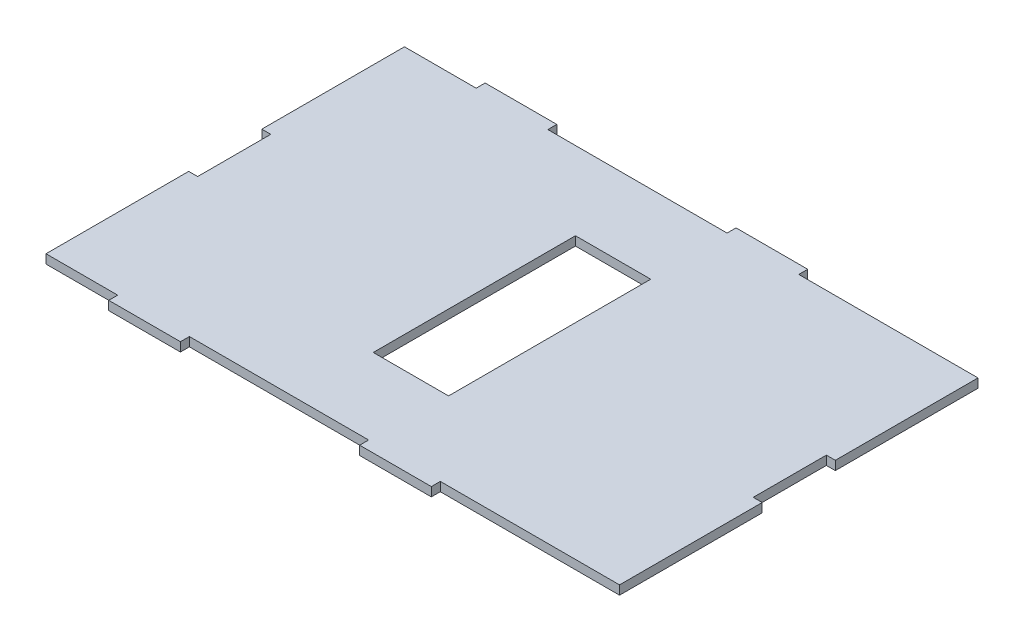
ISO-10303-21;
HEADER;
FILE_DESCRIPTION(('STEP AP214'),'2;1');
FILE_NAME('part.step','',(''),(''),'','','');
FILE_SCHEMA(('AUTOMOTIVE_DESIGN { 1 0 10303 214 1 1 1 1 }'));
ENDSEC;
DATA;
#1=APPLICATION_CONTEXT('core data for automotive mechanical design processes');
#2=APPLICATION_PROTOCOL_DEFINITION('international standard','automotive_design',2000,#1);
#3=PRODUCT_CONTEXT('',#1,'mechanical');
#4=PRODUCT('Part','Part','',(#3));
#5=PRODUCT_RELATED_PRODUCT_CATEGORY('part','',(#4));
#6=PRODUCT_DEFINITION_FORMATION('','',#4);
#7=PRODUCT_DEFINITION_CONTEXT('part definition',#1,'design');
#8=PRODUCT_DEFINITION('design','',#6,#7);
#9=PRODUCT_DEFINITION_SHAPE('','',#8);
#10=(LENGTH_UNIT() NAMED_UNIT(*) SI_UNIT(.MILLI.,.METRE.));
#11=(NAMED_UNIT(*) PLANE_ANGLE_UNIT() SI_UNIT($,.RADIAN.));
#12=(NAMED_UNIT(*) SI_UNIT($,.STERADIAN.) SOLID_ANGLE_UNIT());
#13=UNCERTAINTY_MEASURE_WITH_UNIT(LENGTH_MEASURE(1.E-05),#10,'distance_accuracy_value','');
#14=(GEOMETRIC_REPRESENTATION_CONTEXT(3) GLOBAL_UNCERTAINTY_ASSIGNED_CONTEXT((#13)) GLOBAL_UNIT_ASSIGNED_CONTEXT((#10,
#11,#12)) REPRESENTATION_CONTEXT('',''));
#15=CARTESIAN_POINT('',(0.,0.,0.));
#16=DIRECTION('',(0.,0.,1.));
#17=DIRECTION('',(1.,0.,0.));
#18=AXIS2_PLACEMENT_3D('',#15,#16,#17);
#19=CARTESIAN_POINT('',(-7.51075268817203,3.175,-38.9534946236559));
#20=DIRECTION('',(1.,0.,0.));
#21=DIRECTION('',(0.,0.,-1.));
#22=AXIS2_PLACEMENT_3D('',#19,#20,#21);
#23=PLANE('',#22);
#24=DIRECTION('',(0.,0.,1.));
#25=VECTOR('',#24,1.);
#26=CARTESIAN_POINT('',(-7.51075268817203,3.175,-38.9534946236559));
#27=LINE('',#26,#25);
#28=CARTESIAN_POINT('',(-7.51075268817202,3.175,37.5005053763441));
#29=VERTEX_POINT('',#28);
#30=CARTESIAN_POINT('',(-7.51075268817201,3.175,88.0465053763441));
#31=VERTEX_POINT('',#30);
#32=EDGE_CURVE('E441',#29,#31,#27,.T.);
#33=ORIENTED_EDGE('',*,*,#32,.F.);
#34=DIRECTION('',(0.,1.,0.));
#35=VECTOR('',#34,1.);
#36=CARTESIAN_POINT('',(-7.51075268817202,3.175,37.5005053763441));
#37=LINE('',#36,#35);
#38=CARTESIAN_POINT('',(-7.51075268817202,0.,37.5005053763441));
#39=VERTEX_POINT('',#38);
#40=EDGE_CURVE('E275',#39,#29,#37,.T.);
#41=ORIENTED_EDGE('',*,*,#40,.F.);
#42=DIRECTION('',(0.,0.,1.));
#43=VECTOR('',#42,1.);
#44=CARTESIAN_POINT('',(-7.51075268817203,0.,-38.9534946236559));
#45=LINE('',#44,#43);
#46=CARTESIAN_POINT('',(-7.51075268817201,0.,88.0465053763441));
#47=VERTEX_POINT('',#46);
#48=EDGE_CURVE('E436',#39,#47,#45,.T.);
#49=ORIENTED_EDGE('',*,*,#48,.T.);
#50=DIRECTION('',(0.,-1.,0.));
#51=VECTOR('',#50,1.);
#52=CARTESIAN_POINT('',(-7.51075268817201,3.175,88.0465053763441));
#53=LINE('',#52,#51);
#54=EDGE_CURVE('E11',#31,#47,#53,.T.);
#55=ORIENTED_EDGE('',*,*,#54,.F.);
#56=EDGE_LOOP('',(#33,#41,#49,#55));
#57=FACE_BOUND('',#56,.T.);
#58=ADVANCED_FACE('F33',(#57),#23,.F.);
#59=CARTESIAN_POINT('',(195.689247311828,3.175,-38.9534946236559));
#60=DIRECTION('',(-1.,0.,0.));
#61=DIRECTION('',(0.,0.,1.));
#62=AXIS2_PLACEMENT_3D('',#59,#60,#61);
#63=PLANE('',#62);
#64=DIRECTION('',(0.,0.,-1.));
#65=VECTOR('',#64,1.);
#66=CARTESIAN_POINT('',(195.689247311828,0.,-38.9534946236559));
#67=LINE('',#66,#65);
#68=CARTESIAN_POINT('',(195.689247311828,0.,88.0465053763441));
#69=VERTEX_POINT('',#68);
#70=CARTESIAN_POINT('',(195.689247311828,0.,37.5005053763441));
#71=VERTEX_POINT('',#70);
#72=EDGE_CURVE('E464',#69,#71,#67,.T.);
#73=ORIENTED_EDGE('',*,*,#72,.T.);
#74=DIRECTION('',(0.,-1.,0.));
#75=VECTOR('',#74,1.);
#76=CARTESIAN_POINT('',(195.689247311828,3.175,37.5005053763441));
#77=LINE('',#76,#75);
#78=CARTESIAN_POINT('',(195.689247311828,3.175,37.5005053763441));
#79=VERTEX_POINT('',#78);
#80=EDGE_CURVE('E296',#79,#71,#77,.T.);
#81=ORIENTED_EDGE('',*,*,#80,.F.);
#82=DIRECTION('',(0.,0.,-1.));
#83=VECTOR('',#82,1.);
#84=CARTESIAN_POINT('',(195.689247311828,3.175,-38.9534946236559));
#85=LINE('',#84,#83);
#86=CARTESIAN_POINT('',(195.689247311828,3.175,88.0465053763441));
#87=VERTEX_POINT('',#86);
#88=EDGE_CURVE('E447',#87,#79,#85,.T.);
#89=ORIENTED_EDGE('',*,*,#88,.F.);
#90=DIRECTION('',(0.,-1.,0.));
#91=VECTOR('',#90,1.);
#92=CARTESIAN_POINT('',(195.689247311828,3.175,88.0465053763441));
#93=LINE('',#92,#91);
#94=EDGE_CURVE('E41',#87,#69,#93,.T.);
#95=ORIENTED_EDGE('',*,*,#94,.T.);
#96=EDGE_LOOP('',(#73,#81,#89,#95));
#97=FACE_BOUND('',#96,.T.);
#98=ADVANCED_FACE('F480',(#97),#63,.F.);
#99=CARTESIAN_POINT('',(-7.51075268817203,3.175,-38.9534946236559));
#100=DIRECTION('',(0.,0.,1.));
#101=DIRECTION('',(1.,0.,0.));
#102=AXIS2_PLACEMENT_3D('',#99,#100,#101);
#103=PLANE('',#102);
#104=DIRECTION('',(0.,-1.,0.));
#105=VECTOR('',#104,1.);
#106=CARTESIAN_POINT('',(43.289247311828,3.175,-38.9534946236559));
#107=LINE('',#106,#105);
#108=CARTESIAN_POINT('',(43.289247311828,3.175,-38.9534946236559));
#109=VERTEX_POINT('',#108);
#110=CARTESIAN_POINT('',(43.289247311828,0.,-38.9534946236559));
#111=VERTEX_POINT('',#110);
#112=EDGE_CURVE('E321',#109,#111,#107,.T.);
#113=ORIENTED_EDGE('',*,*,#112,.F.);
#114=DIRECTION('',(-1.,0.,0.));
#115=VECTOR('',#114,1.);
#116=CARTESIAN_POINT('',(-7.51075268817203,3.175,-38.9534946236559));
#117=LINE('',#116,#115);
#118=CARTESIAN_POINT('',(106.789247311828,3.175,-38.9534946236559));
#119=VERTEX_POINT('',#118);
#120=EDGE_CURVE('E455',#119,#109,#117,.T.);
#121=ORIENTED_EDGE('',*,*,#120,.F.);
#122=DIRECTION('',(0.,1.,0.));
#123=VECTOR('',#122,1.);
#124=CARTESIAN_POINT('',(106.789247311828,3.175,-38.9534946236559));
#125=LINE('',#124,#123);
#126=CARTESIAN_POINT('',(106.789247311828,0.,-38.9534946236559));
#127=VERTEX_POINT('',#126);
#128=EDGE_CURVE('E360',#127,#119,#125,.T.);
#129=ORIENTED_EDGE('',*,*,#128,.F.);
#130=DIRECTION('',(-1.,0.,0.));
#131=VECTOR('',#130,1.);
#132=CARTESIAN_POINT('',(-7.51075268817203,0.,-38.9534946236559));
#133=LINE('',#132,#131);
#134=EDGE_CURVE('E470',#127,#111,#133,.T.);
#135=ORIENTED_EDGE('',*,*,#134,.T.);
#136=EDGE_LOOP('',(#113,#121,#129,#135));
#137=FACE_BOUND('',#136,.T.);
#138=ADVANCED_FACE('F531',(#137),#103,.F.);
#139=DIRECTION('',(0.,1.,0.));
#140=VECTOR('',#139,1.);
#141=CARTESIAN_POINT('',(17.889247311828,3.175,-38.9534946236559));
#142=LINE('',#141,#140);
#143=CARTESIAN_POINT('',(17.889247311828,0.,-38.9534946236559));
#144=VERTEX_POINT('',#143);
#145=CARTESIAN_POINT('',(17.889247311828,3.175,-38.9534946236559));
#146=VERTEX_POINT('',#145);
#147=EDGE_CURVE('E333',#144,#146,#142,.T.);
#148=ORIENTED_EDGE('',*,*,#147,.F.);
#149=CARTESIAN_POINT('',(-7.51075268817203,0.,-38.9534946236559));
#150=VERTEX_POINT('',#149);
#151=EDGE_CURVE('E467',#144,#150,#133,.T.);
#152=ORIENTED_EDGE('',*,*,#151,.T.);
#153=DIRECTION('',(0.,-1.,0.));
#154=VECTOR('',#153,1.);
#155=CARTESIAN_POINT('',(-7.51075268817203,3.175,-38.9534946236559));
#156=LINE('',#155,#154);
#157=CARTESIAN_POINT('',(-7.51075268817203,3.175,-38.9534946236559));
#158=VERTEX_POINT('',#157);
#159=EDGE_CURVE('E454',#158,#150,#156,.T.);
#160=ORIENTED_EDGE('',*,*,#159,.F.);
#161=EDGE_CURVE('E450',#146,#158,#117,.T.);
#162=ORIENTED_EDGE('',*,*,#161,.F.);
#163=EDGE_LOOP('',(#148,#152,#160,#162));
#164=FACE_BOUND('',#163,.T.);
#165=ADVANCED_FACE('F565',(#164),#103,.F.);
#166=DIRECTION('',(0.,-1.,0.));
#167=VECTOR('',#166,1.);
#168=CARTESIAN_POINT('',(132.189247311828,3.175,-38.9534946236559));
#169=LINE('',#168,#167);
#170=CARTESIAN_POINT('',(132.189247311828,3.175,-38.9534946236559));
#171=VERTEX_POINT('',#170);
#172=CARTESIAN_POINT('',(132.189247311828,0.,-38.9534946236559));
#173=VERTEX_POINT('',#172);
#174=EDGE_CURVE('E355',#171,#173,#169,.T.);
#175=ORIENTED_EDGE('',*,*,#174,.F.);
#176=CARTESIAN_POINT('',(195.689247311828,3.175,-38.9534946236559));
#177=VERTEX_POINT('',#176);
#178=EDGE_CURVE('E451',#177,#171,#117,.T.);
#179=ORIENTED_EDGE('',*,*,#178,.F.);
#180=DIRECTION('',(0.,-1.,0.));
#181=VECTOR('',#180,1.);
#182=CARTESIAN_POINT('',(195.689247311828,3.175,-38.9534946236559));
#183=LINE('',#182,#181);
#184=CARTESIAN_POINT('',(195.689247311828,0.,-38.9534946236559));
#185=VERTEX_POINT('',#184);
#186=EDGE_CURVE('E473',#177,#185,#183,.T.);
#187=ORIENTED_EDGE('',*,*,#186,.T.);
#188=EDGE_CURVE('E468',#185,#173,#133,.T.);
#189=ORIENTED_EDGE('',*,*,#188,.T.);
#190=EDGE_LOOP('',(#175,#179,#187,#189));
#191=FACE_BOUND('',#190,.T.);
#192=ADVANCED_FACE('F524',(#191),#103,.F.);
#193=CARTESIAN_POINT('',(-7.51075268817201,3.175,88.0465053763441));
#194=DIRECTION('',(0.,0.,-1.));
#195=DIRECTION('',(-1.,0.,0.));
#196=AXIS2_PLACEMENT_3D('',#193,#194,#195);
#197=PLANE('',#196);
#198=DIRECTION('',(0.,-1.,0.));
#199=VECTOR('',#198,1.);
#200=CARTESIAN_POINT('',(17.889247311828,3.175,88.0465053763441));
#201=LINE('',#200,#199);
#202=CARTESIAN_POINT('',(17.889247311828,3.175,88.0465053763441));
#203=VERTEX_POINT('',#202);
#204=CARTESIAN_POINT('',(17.889247311828,0.,88.0465053763441));
#205=VERTEX_POINT('',#204);
#206=EDGE_CURVE('E382',#203,#205,#201,.T.);
#207=ORIENTED_EDGE('',*,*,#206,.F.);
#208=DIRECTION('',(1.,0.,0.));
#209=VECTOR('',#208,1.);
#210=CARTESIAN_POINT('',(-7.51075268817201,3.175,88.0465053763441));
#211=LINE('',#210,#209);
#212=EDGE_CURVE('E442',#31,#203,#211,.T.);
#213=ORIENTED_EDGE('',*,*,#212,.F.);
#214=ORIENTED_EDGE('',*,*,#54,.T.);
#215=DIRECTION('',(1.,0.,0.));
#216=VECTOR('',#215,1.);
#217=CARTESIAN_POINT('',(-7.51075268817201,0.,88.0465053763441));
#218=LINE('',#217,#216);
#219=EDGE_CURVE('E460',#47,#205,#218,.T.);
#220=ORIENTED_EDGE('',*,*,#219,.T.);
#221=EDGE_LOOP('',(#207,#213,#214,#220));
#222=FACE_BOUND('',#221,.T.);
#223=ADVANCED_FACE('F515',(#222),#197,.F.);
#224=DIRECTION('',(0.,1.,0.));
#225=VECTOR('',#224,1.);
#226=CARTESIAN_POINT('',(43.289247311828,3.175,88.0465053763441));
#227=LINE('',#226,#225);
#228=CARTESIAN_POINT('',(43.289247311828,0.,88.0465053763441));
#229=VERTEX_POINT('',#228);
#230=CARTESIAN_POINT('',(43.289247311828,3.175,88.0465053763441));
#231=VERTEX_POINT('',#230);
#232=EDGE_CURVE('E387',#229,#231,#227,.T.);
#233=ORIENTED_EDGE('',*,*,#232,.F.);
#234=CARTESIAN_POINT('',(106.789247311828,0.,88.0465053763441));
#235=VERTEX_POINT('',#234);
#236=EDGE_CURVE('E463',#229,#235,#218,.T.);
#237=ORIENTED_EDGE('',*,*,#236,.T.);
#238=DIRECTION('',(0.,-1.,0.));
#239=VECTOR('',#238,1.);
#240=CARTESIAN_POINT('',(106.789247311828,3.175,88.0465053763441));
#241=LINE('',#240,#239);
#242=CARTESIAN_POINT('',(106.789247311828,3.175,88.0465053763441));
#243=VERTEX_POINT('',#242);
#244=EDGE_CURVE('E409',#243,#235,#241,.T.);
#245=ORIENTED_EDGE('',*,*,#244,.F.);
#246=EDGE_CURVE('E446',#231,#243,#211,.T.);
#247=ORIENTED_EDGE('',*,*,#246,.F.);
#248=EDGE_LOOP('',(#233,#237,#245,#247));
#249=FACE_BOUND('',#248,.T.);
#250=ADVANCED_FACE('F504',(#249),#197,.F.);
#251=DIRECTION('',(0.,1.,0.));
#252=VECTOR('',#251,1.);
#253=CARTESIAN_POINT('',(132.189247311828,3.175,88.0465053763441));
#254=LINE('',#253,#252);
#255=CARTESIAN_POINT('',(132.189247311828,0.,88.0465053763441));
#256=VERTEX_POINT('',#255);
#257=CARTESIAN_POINT('',(132.189247311828,3.175,88.0465053763441));
#258=VERTEX_POINT('',#257);
#259=EDGE_CURVE('E414',#256,#258,#254,.T.);
#260=ORIENTED_EDGE('',*,*,#259,.F.);
#261=EDGE_CURVE('E459',#256,#69,#218,.T.);
#262=ORIENTED_EDGE('',*,*,#261,.T.);
#263=ORIENTED_EDGE('',*,*,#94,.F.);
#264=EDGE_CURVE('E440',#258,#87,#211,.T.);
#265=ORIENTED_EDGE('',*,*,#264,.F.);
#266=EDGE_LOOP('',(#260,#262,#263,#265));
#267=FACE_BOUND('',#266,.T.);
#268=ADVANCED_FACE('F513',(#267),#197,.F.);
#269=CARTESIAN_POINT('',(-7.51075268817202,0.,11.5925053763441));
#270=VERTEX_POINT('',#269);
#271=EDGE_CURVE('E456',#150,#270,#45,.T.);
#272=ORIENTED_EDGE('',*,*,#271,.T.);
#273=DIRECTION('',(0.,-1.,0.));
#274=VECTOR('',#273,1.);
#275=CARTESIAN_POINT('',(-7.51075268817202,3.175,11.5925053763441));
#276=LINE('',#275,#274);
#277=CARTESIAN_POINT('',(-7.51075268817202,3.175,11.5925053763441));
#278=VERTEX_POINT('',#277);
#279=EDGE_CURVE('E283',#278,#270,#276,.T.);
#280=ORIENTED_EDGE('',*,*,#279,.F.);
#281=EDGE_CURVE('E437',#158,#278,#27,.T.);
#282=ORIENTED_EDGE('',*,*,#281,.F.);
#283=ORIENTED_EDGE('',*,*,#159,.T.);
#284=EDGE_LOOP('',(#272,#280,#282,#283));
#285=FACE_BOUND('',#284,.T.);
#286=ADVANCED_FACE('F35',(#285),#23,.F.);
#287=CARTESIAN_POINT('',(195.689247311828,3.175,11.5925053763441));
#288=VERTEX_POINT('',#287);
#289=EDGE_CURVE('E445',#288,#177,#85,.T.);
#290=ORIENTED_EDGE('',*,*,#289,.F.);
#291=DIRECTION('',(0.,1.,0.));
#292=VECTOR('',#291,1.);
#293=CARTESIAN_POINT('',(195.689247311828,3.175,11.5925053763441));
#294=LINE('',#293,#292);
#295=CARTESIAN_POINT('',(195.689247311828,0.,11.5925053763441));
#296=VERTEX_POINT('',#295);
#297=EDGE_CURVE('E307',#296,#288,#294,.T.);
#298=ORIENTED_EDGE('',*,*,#297,.F.);
#299=EDGE_CURVE('E462',#296,#185,#67,.T.);
#300=ORIENTED_EDGE('',*,*,#299,.T.);
#301=ORIENTED_EDGE('',*,*,#186,.F.);
#302=EDGE_LOOP('',(#290,#298,#300,#301));
#303=FACE_BOUND('',#302,.T.);
#304=ADVANCED_FACE('F520',(#303),#63,.F.);
#305=CARTESIAN_POINT('',(0.,3.175,0.));
#306=DIRECTION('',(0.,1.,0.));
#307=DIRECTION('',(0.,0.,1.));
#308=AXIS2_PLACEMENT_3D('',#305,#306,#307);
#309=PLANE('',#308);
#310=DIRECTION('',(0.,0.,1.));
#311=VECTOR('',#310,1.);
#312=CARTESIAN_POINT('',(80.754247311828,3.175,60.3605053763441));
#313=LINE('',#312,#311);
#314=CARTESIAN_POINT('',(80.754247311828,3.175,-11.2674946236559));
#315=VERTEX_POINT('',#314);
#316=CARTESIAN_POINT('',(80.754247311828,3.175,60.3605053763441));
#317=VERTEX_POINT('',#316);
#318=EDGE_CURVE('E48',#315,#317,#313,.T.);
#319=ORIENTED_EDGE('',*,*,#318,.F.);
#320=DIRECTION('',(-1.,0.,0.));
#321=VECTOR('',#320,1.);
#322=CARTESIAN_POINT('',(107.424247311828,3.175,-11.2674946236559));
#323=LINE('',#322,#321);
#324=CARTESIAN_POINT('',(107.424247311828,3.175,-11.2674946236559));
#325=VERTEX_POINT('',#324);
#326=EDGE_CURVE('E260',#325,#315,#323,.T.);
#327=ORIENTED_EDGE('',*,*,#326,.F.);
#328=DIRECTION('',(0.,0.,-1.));
#329=VECTOR('',#328,1.);
#330=CARTESIAN_POINT('',(107.424247311828,3.175,60.3605053763441));
#331=LINE('',#330,#329);
#332=CARTESIAN_POINT('',(107.424247311828,3.175,60.3605053763441));
#333=VERTEX_POINT('',#332);
#334=EDGE_CURVE('E263',#333,#325,#331,.T.);
#335=ORIENTED_EDGE('',*,*,#334,.F.);
#336=DIRECTION('',(1.,0.,0.));
#337=VECTOR('',#336,1.);
#338=CARTESIAN_POINT('',(107.424247311828,3.175,60.3605053763441));
#339=LINE('',#338,#337);
#340=EDGE_CURVE('E269',#317,#333,#339,.T.);
#341=ORIENTED_EDGE('',*,*,#340,.F.);
#342=EDGE_LOOP('',(#319,#327,#335,#341));
#343=FACE_BOUND('',#342,.T.);
#344=DIRECTION('',(-1.,0.,0.));
#345=VECTOR('',#344,1.);
#346=CARTESIAN_POINT('',(-4.33575268817202,3.175,37.5005053763441));
#347=LINE('',#346,#345);
#348=CARTESIAN_POINT('',(-4.33575268817202,3.175,37.5005053763441));
#349=VERTEX_POINT('',#348);
#350=EDGE_CURVE('E291',#349,#29,#347,.T.);
#351=ORIENTED_EDGE('',*,*,#350,.T.);
#352=ORIENTED_EDGE('',*,*,#32,.T.);
#353=ORIENTED_EDGE('',*,*,#212,.T.);
#354=DIRECTION('',(0.,0.,-1.));
#355=VECTOR('',#354,1.);
#356=CARTESIAN_POINT('',(17.889247311828,3.175,91.2215053763441));
#357=LINE('',#356,#355);
#358=CARTESIAN_POINT('',(17.889247311828,3.175,91.2215053763441));
#359=VERTEX_POINT('',#358);
#360=EDGE_CURVE('E393',#359,#203,#357,.T.);
#361=ORIENTED_EDGE('',*,*,#360,.F.);
#362=DIRECTION('',(-1.,0.,0.));
#363=VECTOR('',#362,1.);
#364=CARTESIAN_POINT('',(17.889247311828,3.175,91.2215053763441));
#365=LINE('',#364,#363);
#366=CARTESIAN_POINT('',(43.289247311828,3.175,91.2215053763441));
#367=VERTEX_POINT('',#366);
#368=EDGE_CURVE('E391',#367,#359,#365,.T.);
#369=ORIENTED_EDGE('',*,*,#368,.F.);
#370=DIRECTION('',(0.,0.,-1.));
#371=VECTOR('',#370,1.);
#372=CARTESIAN_POINT('',(43.289247311828,3.175,91.2215053763441));
#373=LINE('',#372,#371);
#374=EDGE_CURVE('E400',#367,#231,#373,.T.);
#375=ORIENTED_EDGE('',*,*,#374,.T.);
#376=ORIENTED_EDGE('',*,*,#246,.T.);
#377=DIRECTION('',(0.,0.,-1.));
#378=VECTOR('',#377,1.);
#379=CARTESIAN_POINT('',(106.789247311828,3.175,91.2215053763441));
#380=LINE('',#379,#378);
#381=CARTESIAN_POINT('',(106.789247311828,3.175,91.2215053763441));
#382=VERTEX_POINT('',#381);
#383=EDGE_CURVE('E420',#382,#243,#380,.T.);
#384=ORIENTED_EDGE('',*,*,#383,.F.);
#385=DIRECTION('',(-1.,0.,0.));
#386=VECTOR('',#385,1.);
#387=CARTESIAN_POINT('',(106.789247311828,3.175,91.2215053763441));
#388=LINE('',#387,#386);
#389=CARTESIAN_POINT('',(132.189247311828,3.175,91.2215053763441));
#390=VERTEX_POINT('',#389);
#391=EDGE_CURVE('E418',#390,#382,#388,.T.);
#392=ORIENTED_EDGE('',*,*,#391,.F.);
#393=DIRECTION('',(0.,0.,-1.));
#394=VECTOR('',#393,1.);
#395=CARTESIAN_POINT('',(132.189247311828,3.175,91.2215053763441));
#396=LINE('',#395,#394);
#397=EDGE_CURVE('E427',#390,#258,#396,.T.);
#398=ORIENTED_EDGE('',*,*,#397,.T.);
#399=ORIENTED_EDGE('',*,*,#264,.T.);
#400=ORIENTED_EDGE('',*,*,#88,.T.);
#401=DIRECTION('',(1.,0.,0.));
#402=VECTOR('',#401,1.);
#403=CARTESIAN_POINT('',(192.514247311828,3.175,37.5005053763441));
#404=LINE('',#403,#402);
#405=CARTESIAN_POINT('',(192.514247311828,3.175,37.5005053763441));
#406=VERTEX_POINT('',#405);
#407=EDGE_CURVE('E319',#406,#79,#404,.T.);
#408=ORIENTED_EDGE('',*,*,#407,.F.);
#409=DIRECTION('',(0.,0.,1.));
#410=VECTOR('',#409,1.);
#411=CARTESIAN_POINT('',(192.514247311828,3.175,37.5005053763441));
#412=LINE('',#411,#410);
#413=CARTESIAN_POINT('',(192.514247311828,3.175,11.5925053763441));
#414=VERTEX_POINT('',#413);
#415=EDGE_CURVE('E313',#414,#406,#412,.T.);
#416=ORIENTED_EDGE('',*,*,#415,.F.);
#417=DIRECTION('',(1.,0.,0.));
#418=VECTOR('',#417,1.);
#419=CARTESIAN_POINT('',(192.514247311828,3.175,11.5925053763441));
#420=LINE('',#419,#418);
#421=EDGE_CURVE('E322',#414,#288,#420,.T.);
#422=ORIENTED_EDGE('',*,*,#421,.T.);
#423=ORIENTED_EDGE('',*,*,#289,.T.);
#424=ORIENTED_EDGE('',*,*,#178,.T.);
#425=DIRECTION('',(0.,0.,1.));
#426=VECTOR('',#425,1.);
#427=CARTESIAN_POINT('',(132.189247311828,3.175,-42.1284946236559));
#428=LINE('',#427,#426);
#429=CARTESIAN_POINT('',(132.189247311828,3.175,-42.1284946236559));
#430=VERTEX_POINT('',#429);
#431=EDGE_CURVE('E366',#430,#171,#428,.T.);
#432=ORIENTED_EDGE('',*,*,#431,.F.);
#433=DIRECTION('',(1.,0.,0.));
#434=VECTOR('',#433,1.);
#435=CARTESIAN_POINT('',(132.189247311828,3.175,-42.1284946236559));
#436=LINE('',#435,#434);
#437=CARTESIAN_POINT('',(106.789247311828,3.175,-42.1284946236559));
#438=VERTEX_POINT('',#437);
#439=EDGE_CURVE('E364',#438,#430,#436,.T.);
#440=ORIENTED_EDGE('',*,*,#439,.F.);
#441=DIRECTION('',(0.,0.,1.));
#442=VECTOR('',#441,1.);
#443=CARTESIAN_POINT('',(106.789247311828,3.175,-42.1284946236559));
#444=LINE('',#443,#442);
#445=EDGE_CURVE('E373',#438,#119,#444,.T.);
#446=ORIENTED_EDGE('',*,*,#445,.T.);
#447=ORIENTED_EDGE('',*,*,#120,.T.);
#448=DIRECTION('',(0.,0.,1.));
#449=VECTOR('',#448,1.);
#450=CARTESIAN_POINT('',(43.289247311828,3.175,-42.1284946236559));
#451=LINE('',#450,#449);
#452=CARTESIAN_POINT('',(43.289247311828,3.175,-42.1284946236559));
#453=VERTEX_POINT('',#452);
#454=EDGE_CURVE('E339',#453,#109,#451,.T.);
#455=ORIENTED_EDGE('',*,*,#454,.F.);
#456=DIRECTION('',(1.,0.,0.));
#457=VECTOR('',#456,1.);
#458=CARTESIAN_POINT('',(43.289247311828,3.175,-42.1284946236559));
#459=LINE('',#458,#457);
#460=CARTESIAN_POINT('',(17.889247311828,3.175,-42.1284946236559));
#461=VERTEX_POINT('',#460);
#462=EDGE_CURVE('E337',#461,#453,#459,.T.);
#463=ORIENTED_EDGE('',*,*,#462,.F.);
#464=DIRECTION('',(0.,0.,1.));
#465=VECTOR('',#464,1.);
#466=CARTESIAN_POINT('',(17.889247311828,3.175,-42.1284946236559));
#467=LINE('',#466,#465);
#468=EDGE_CURVE('E346',#461,#146,#467,.T.);
#469=ORIENTED_EDGE('',*,*,#468,.T.);
#470=ORIENTED_EDGE('',*,*,#161,.T.);
#471=ORIENTED_EDGE('',*,*,#281,.T.);
#472=DIRECTION('',(-1.,0.,0.));
#473=VECTOR('',#472,1.);
#474=CARTESIAN_POINT('',(-4.33575268817202,3.175,11.5925053763441));
#475=LINE('',#474,#473);
#476=CARTESIAN_POINT('',(-4.33575268817202,3.175,11.5925053763441));
#477=VERTEX_POINT('',#476);
#478=EDGE_CURVE('E300',#477,#278,#475,.T.);
#479=ORIENTED_EDGE('',*,*,#478,.F.);
#480=DIRECTION('',(0.,0.,-1.));
#481=VECTOR('',#480,1.);
#482=CARTESIAN_POINT('',(-4.33575268817202,3.175,37.5005053763441));
#483=LINE('',#482,#481);
#484=EDGE_CURVE('E282',#349,#477,#483,.T.);
#485=ORIENTED_EDGE('',*,*,#484,.F.);
#486=EDGE_LOOP('',(#351,#352,#353,#361,#369,#375,#376,#384,#392,#398,#399,#400,#408,#416,#422,
#423,#424,#432,#440,#446,#447,#455,#463,#469,#470,#471,#479,#485));
#487=FACE_BOUND('',#486,.T.);
#488=ADVANCED_FACE('F493',(#343,#487),#309,.T.);
#489=CARTESIAN_POINT('',(0.,0.,0.));
#490=DIRECTION('',(0.,1.,0.));
#491=DIRECTION('',(0.,0.,1.));
#492=AXIS2_PLACEMENT_3D('',#489,#490,#491);
#493=PLANE('',#492);
#494=DIRECTION('',(-1.,0.,0.));
#495=VECTOR('',#494,1.);
#496=CARTESIAN_POINT('',(107.424247311828,0.,-11.2674946236559));
#497=LINE('',#496,#495);
#498=CARTESIAN_POINT('',(107.424247311828,0.,-11.2674946236559));
#499=VERTEX_POINT('',#498);
#500=CARTESIAN_POINT('',(80.754247311828,0.,-11.2674946236559));
#501=VERTEX_POINT('',#500);
#502=EDGE_CURVE('E250',#499,#501,#497,.T.);
#503=ORIENTED_EDGE('',*,*,#502,.T.);
#504=DIRECTION('',(0.,0.,1.));
#505=VECTOR('',#504,1.);
#506=CARTESIAN_POINT('',(80.754247311828,0.,60.3605053763441));
#507=LINE('',#506,#505);
#508=CARTESIAN_POINT('',(80.754247311828,0.,60.3605053763441));
#509=VERTEX_POINT('',#508);
#510=EDGE_CURVE('E244',#501,#509,#507,.T.);
#511=ORIENTED_EDGE('',*,*,#510,.T.);
#512=DIRECTION('',(1.,0.,0.));
#513=VECTOR('',#512,1.);
#514=CARTESIAN_POINT('',(107.424247311828,0.,60.3605053763441));
#515=LINE('',#514,#513);
#516=CARTESIAN_POINT('',(107.424247311828,0.,60.3605053763441));
#517=VERTEX_POINT('',#516);
#518=EDGE_CURVE('E253',#509,#517,#515,.T.);
#519=ORIENTED_EDGE('',*,*,#518,.T.);
#520=DIRECTION('',(0.,0.,-1.));
#521=VECTOR('',#520,1.);
#522=CARTESIAN_POINT('',(107.424247311828,0.,60.3605053763441));
#523=LINE('',#522,#521);
#524=EDGE_CURVE('E56',#517,#499,#523,.T.);
#525=ORIENTED_EDGE('',*,*,#524,.T.);
#526=EDGE_LOOP('',(#503,#511,#519,#525));
#527=FACE_BOUND('',#526,.T.);
#528=ORIENTED_EDGE('',*,*,#48,.F.);
#529=DIRECTION('',(-1.,0.,0.));
#530=VECTOR('',#529,1.);
#531=CARTESIAN_POINT('',(-4.33575268817202,0.,37.5005053763441));
#532=LINE('',#531,#530);
#533=CARTESIAN_POINT('',(-4.33575268817202,0.,37.5005053763441));
#534=VERTEX_POINT('',#533);
#535=EDGE_CURVE('E294',#534,#39,#532,.T.);
#536=ORIENTED_EDGE('',*,*,#535,.F.);
#537=DIRECTION('',(0.,0.,1.));
#538=VECTOR('',#537,1.);
#539=CARTESIAN_POINT('',(-4.33575268817202,0.,37.5005053763441));
#540=LINE('',#539,#538);
#541=CARTESIAN_POINT('',(-4.33575268817202,0.,11.5925053763441));
#542=VERTEX_POINT('',#541);
#543=EDGE_CURVE('E288',#542,#534,#540,.T.);
#544=ORIENTED_EDGE('',*,*,#543,.F.);
#545=DIRECTION('',(-1.,0.,0.));
#546=VECTOR('',#545,1.);
#547=CARTESIAN_POINT('',(-4.33575268817202,0.,11.5925053763441));
#548=LINE('',#547,#546);
#549=EDGE_CURVE('E297',#542,#270,#548,.T.);
#550=ORIENTED_EDGE('',*,*,#549,.T.);
#551=ORIENTED_EDGE('',*,*,#271,.F.);
#552=ORIENTED_EDGE('',*,*,#151,.F.);
#553=DIRECTION('',(0.,0.,1.));
#554=VECTOR('',#553,1.);
#555=CARTESIAN_POINT('',(17.889247311828,0.,-42.1284946236559));
#556=LINE('',#555,#554);
#557=CARTESIAN_POINT('',(17.889247311828,0.,-42.1284946236559));
#558=VERTEX_POINT('',#557);
#559=EDGE_CURVE('E349',#558,#144,#556,.T.);
#560=ORIENTED_EDGE('',*,*,#559,.F.);
#561=DIRECTION('',(-1.,0.,0.));
#562=VECTOR('',#561,1.);
#563=CARTESIAN_POINT('',(43.289247311828,0.,-42.1284946236559));
#564=LINE('',#563,#562);
#565=CARTESIAN_POINT('',(43.289247311828,0.,-42.1284946236559));
#566=VERTEX_POINT('',#565);
#567=EDGE_CURVE('E332',#566,#558,#564,.T.);
#568=ORIENTED_EDGE('',*,*,#567,.F.);
#569=DIRECTION('',(0.,0.,1.));
#570=VECTOR('',#569,1.);
#571=CARTESIAN_POINT('',(43.289247311828,0.,-42.1284946236559));
#572=LINE('',#571,#570);
#573=EDGE_CURVE('E352',#566,#111,#572,.T.);
#574=ORIENTED_EDGE('',*,*,#573,.T.);
#575=ORIENTED_EDGE('',*,*,#134,.F.);
#576=DIRECTION('',(0.,0.,1.));
#577=VECTOR('',#576,1.);
#578=CARTESIAN_POINT('',(106.789247311828,0.,-42.1284946236559));
#579=LINE('',#578,#577);
#580=CARTESIAN_POINT('',(106.789247311828,0.,-42.1284946236559));
#581=VERTEX_POINT('',#580);
#582=EDGE_CURVE('E376',#581,#127,#579,.T.);
#583=ORIENTED_EDGE('',*,*,#582,.F.);
#584=DIRECTION('',(-1.,0.,0.));
#585=VECTOR('',#584,1.);
#586=CARTESIAN_POINT('',(132.189247311828,0.,-42.1284946236559));
#587=LINE('',#586,#585);
#588=CARTESIAN_POINT('',(132.189247311828,0.,-42.1284946236559));
#589=VERTEX_POINT('',#588);
#590=EDGE_CURVE('E359',#589,#581,#587,.T.);
#591=ORIENTED_EDGE('',*,*,#590,.F.);
#592=DIRECTION('',(0.,0.,1.));
#593=VECTOR('',#592,1.);
#594=CARTESIAN_POINT('',(132.189247311828,0.,-42.1284946236559));
#595=LINE('',#594,#593);
#596=EDGE_CURVE('E379',#589,#173,#595,.T.);
#597=ORIENTED_EDGE('',*,*,#596,.T.);
#598=ORIENTED_EDGE('',*,*,#188,.F.);
#599=ORIENTED_EDGE('',*,*,#299,.F.);
#600=DIRECTION('',(1.,0.,0.));
#601=VECTOR('',#600,1.);
#602=CARTESIAN_POINT('',(192.514247311828,0.,11.5925053763441));
#603=LINE('',#602,#601);
#604=CARTESIAN_POINT('',(192.514247311828,0.,11.5925053763441));
#605=VERTEX_POINT('',#604);
#606=EDGE_CURVE('E325',#605,#296,#603,.T.);
#607=ORIENTED_EDGE('',*,*,#606,.F.);
#608=DIRECTION('',(0.,0.,-1.));
#609=VECTOR('',#608,1.);
#610=CARTESIAN_POINT('',(192.514247311828,0.,37.5005053763441));
#611=LINE('',#610,#609);
#612=CARTESIAN_POINT('',(192.514247311828,0.,37.5005053763441));
#613=VERTEX_POINT('',#612);
#614=EDGE_CURVE('E306',#613,#605,#611,.T.);
#615=ORIENTED_EDGE('',*,*,#614,.F.);
#616=DIRECTION('',(1.,0.,0.));
#617=VECTOR('',#616,1.);
#618=CARTESIAN_POINT('',(192.514247311828,0.,37.5005053763441));
#619=LINE('',#618,#617);
#620=EDGE_CURVE('E316',#613,#71,#619,.T.);
#621=ORIENTED_EDGE('',*,*,#620,.T.);
#622=ORIENTED_EDGE('',*,*,#72,.F.);
#623=ORIENTED_EDGE('',*,*,#261,.F.);
#624=DIRECTION('',(0.,0.,-1.));
#625=VECTOR('',#624,1.);
#626=CARTESIAN_POINT('',(132.189247311828,0.,91.2215053763441));
#627=LINE('',#626,#625);
#628=CARTESIAN_POINT('',(132.189247311828,0.,91.2215053763441));
#629=VERTEX_POINT('',#628);
#630=EDGE_CURVE('E430',#629,#256,#627,.T.);
#631=ORIENTED_EDGE('',*,*,#630,.F.);
#632=DIRECTION('',(1.,0.,0.));
#633=VECTOR('',#632,1.);
#634=CARTESIAN_POINT('',(106.789247311828,0.,91.2215053763441));
#635=LINE('',#634,#633);
#636=CARTESIAN_POINT('',(106.789247311828,0.,91.2215053763441));
#637=VERTEX_POINT('',#636);
#638=EDGE_CURVE('E413',#637,#629,#635,.T.);
#639=ORIENTED_EDGE('',*,*,#638,.F.);
#640=DIRECTION('',(0.,0.,-1.));
#641=VECTOR('',#640,1.);
#642=CARTESIAN_POINT('',(106.789247311828,0.,91.2215053763441));
#643=LINE('',#642,#641);
#644=EDGE_CURVE('E433',#637,#235,#643,.T.);
#645=ORIENTED_EDGE('',*,*,#644,.T.);
#646=ORIENTED_EDGE('',*,*,#236,.F.);
#647=DIRECTION('',(0.,0.,-1.));
#648=VECTOR('',#647,1.);
#649=CARTESIAN_POINT('',(43.289247311828,0.,91.2215053763441));
#650=LINE('',#649,#648);
#651=CARTESIAN_POINT('',(43.289247311828,0.,91.2215053763441));
#652=VERTEX_POINT('',#651);
#653=EDGE_CURVE('E403',#652,#229,#650,.T.);
#654=ORIENTED_EDGE('',*,*,#653,.F.);
#655=DIRECTION('',(1.,0.,0.));
#656=VECTOR('',#655,1.);
#657=CARTESIAN_POINT('',(17.889247311828,0.,91.2215053763441));
#658=LINE('',#657,#656);
#659=CARTESIAN_POINT('',(17.889247311828,0.,91.2215053763441));
#660=VERTEX_POINT('',#659);
#661=EDGE_CURVE('E386',#660,#652,#658,.T.);
#662=ORIENTED_EDGE('',*,*,#661,.F.);
#663=DIRECTION('',(0.,0.,-1.));
#664=VECTOR('',#663,1.);
#665=CARTESIAN_POINT('',(17.889247311828,0.,91.2215053763441));
#666=LINE('',#665,#664);
#667=EDGE_CURVE('E406',#660,#205,#666,.T.);
#668=ORIENTED_EDGE('',*,*,#667,.T.);
#669=ORIENTED_EDGE('',*,*,#219,.F.);
#670=EDGE_LOOP('',(#528,#536,#544,#550,#551,#552,#560,#568,#574,#575,#583,#591,#597,#598,#599,
#607,#615,#621,#622,#623,#631,#639,#645,#646,#654,#662,#668,#669));
#671=FACE_BOUND('',#670,.T.);
#672=ADVANCED_FACE('F257',(#527,#671),#493,.F.);
#673=CARTESIAN_POINT('',(106.789247311828,3.175,91.2215053763441));
#674=DIRECTION('',(1.,0.,0.));
#675=DIRECTION('',(0.,0.,-1.));
#676=AXIS2_PLACEMENT_3D('',#673,#674,#675);
#677=PLANE('',#676);
#678=ORIENTED_EDGE('',*,*,#244,.T.);
#679=ORIENTED_EDGE('',*,*,#644,.F.);
#680=DIRECTION('',(0.,-1.,0.));
#681=VECTOR('',#680,1.);
#682=CARTESIAN_POINT('',(106.789247311828,3.175,91.2215053763441));
#683=LINE('',#682,#681);
#684=EDGE_CURVE('E410',#382,#637,#683,.T.);
#685=ORIENTED_EDGE('',*,*,#684,.F.);
#686=ORIENTED_EDGE('',*,*,#383,.T.);
#687=EDGE_LOOP('',(#678,#679,#685,#686));
#688=FACE_BOUND('',#687,.T.);
#689=ADVANCED_FACE('F507',(#688),#677,.F.);
#690=CARTESIAN_POINT('',(132.189247311828,3.175,91.2215053763441));
#691=DIRECTION('',(-1.,0.,0.));
#692=DIRECTION('',(0.,0.,1.));
#693=AXIS2_PLACEMENT_3D('',#690,#691,#692);
#694=PLANE('',#693);
#695=ORIENTED_EDGE('',*,*,#259,.T.);
#696=ORIENTED_EDGE('',*,*,#397,.F.);
#697=DIRECTION('',(0.,1.,0.));
#698=VECTOR('',#697,1.);
#699=CARTESIAN_POINT('',(132.189247311828,3.175,91.2215053763441));
#700=LINE('',#699,#698);
#701=EDGE_CURVE('E416',#629,#390,#700,.T.);
#702=ORIENTED_EDGE('',*,*,#701,.F.);
#703=ORIENTED_EDGE('',*,*,#630,.T.);
#704=EDGE_LOOP('',(#695,#696,#702,#703));
#705=FACE_BOUND('',#704,.T.);
#706=ADVANCED_FACE('F512',(#705),#694,.F.);
#707=CARTESIAN_POINT('',(0.,0.,91.2215053763441));
#708=DIRECTION('',(0.,0.,1.));
#709=DIRECTION('',(1.,0.,0.));
#710=AXIS2_PLACEMENT_3D('',#707,#708,#709);
#711=PLANE('',#710);
#712=ORIENTED_EDGE('',*,*,#684,.T.);
#713=ORIENTED_EDGE('',*,*,#638,.T.);
#714=ORIENTED_EDGE('',*,*,#701,.T.);
#715=ORIENTED_EDGE('',*,*,#391,.T.);
#716=EDGE_LOOP('',(#712,#713,#714,#715));
#717=FACE_BOUND('',#716,.T.);
#718=ADVANCED_FACE('F509',(#717),#711,.T.);
#719=CARTESIAN_POINT('',(17.889247311828,3.175,91.2215053763441));
#720=DIRECTION('',(1.,0.,0.));
#721=DIRECTION('',(0.,0.,-1.));
#722=AXIS2_PLACEMENT_3D('',#719,#720,#721);
#723=PLANE('',#722);
#724=ORIENTED_EDGE('',*,*,#206,.T.);
#725=ORIENTED_EDGE('',*,*,#667,.F.);
#726=DIRECTION('',(0.,-1.,0.));
#727=VECTOR('',#726,1.);
#728=CARTESIAN_POINT('',(17.889247311828,3.175,91.2215053763441));
#729=LINE('',#728,#727);
#730=EDGE_CURVE('E383',#359,#660,#729,.T.);
#731=ORIENTED_EDGE('',*,*,#730,.F.);
#732=ORIENTED_EDGE('',*,*,#360,.T.);
#733=EDGE_LOOP('',(#724,#725,#731,#732));
#734=FACE_BOUND('',#733,.T.);
#735=ADVANCED_FACE('F541',(#734),#723,.F.);
#736=CARTESIAN_POINT('',(43.289247311828,3.175,91.2215053763441));
#737=DIRECTION('',(-1.,0.,0.));
#738=DIRECTION('',(0.,0.,1.));
#739=AXIS2_PLACEMENT_3D('',#736,#737,#738);
#740=PLANE('',#739);
#741=ORIENTED_EDGE('',*,*,#232,.T.);
#742=ORIENTED_EDGE('',*,*,#374,.F.);
#743=DIRECTION('',(0.,1.,0.));
#744=VECTOR('',#743,1.);
#745=CARTESIAN_POINT('',(43.289247311828,3.175,91.2215053763441));
#746=LINE('',#745,#744);
#747=EDGE_CURVE('E389',#652,#367,#746,.T.);
#748=ORIENTED_EDGE('',*,*,#747,.F.);
#749=ORIENTED_EDGE('',*,*,#653,.T.);
#750=EDGE_LOOP('',(#741,#742,#748,#749));
#751=FACE_BOUND('',#750,.T.);
#752=ADVANCED_FACE('F548',(#751),#740,.F.);
#753=CARTESIAN_POINT('',(0.,0.,91.2215053763441));
#754=DIRECTION('',(0.,0.,1.));
#755=DIRECTION('',(1.,0.,0.));
#756=AXIS2_PLACEMENT_3D('',#753,#754,#755);
#757=PLANE('',#756);
#758=ORIENTED_EDGE('',*,*,#730,.T.);
#759=ORIENTED_EDGE('',*,*,#661,.T.);
#760=ORIENTED_EDGE('',*,*,#747,.T.);
#761=ORIENTED_EDGE('',*,*,#368,.T.);
#762=EDGE_LOOP('',(#758,#759,#760,#761));
#763=FACE_BOUND('',#762,.T.);
#764=ADVANCED_FACE('F544',(#763),#757,.T.);
#765=CARTESIAN_POINT('',(132.189247311828,3.175,-42.1284946236559));
#766=DIRECTION('',(-1.,0.,0.));
#767=DIRECTION('',(0.,0.,1.));
#768=AXIS2_PLACEMENT_3D('',#765,#766,#767);
#769=PLANE('',#768);
#770=ORIENTED_EDGE('',*,*,#174,.T.);
#771=ORIENTED_EDGE('',*,*,#596,.F.);
#772=DIRECTION('',(0.,-1.,0.));
#773=VECTOR('',#772,1.);
#774=CARTESIAN_POINT('',(132.189247311828,3.175,-42.1284946236559));
#775=LINE('',#774,#773);
#776=EDGE_CURVE('E356',#430,#589,#775,.T.);
#777=ORIENTED_EDGE('',*,*,#776,.F.);
#778=ORIENTED_EDGE('',*,*,#431,.T.);
#779=EDGE_LOOP('',(#770,#771,#777,#778));
#780=FACE_BOUND('',#779,.T.);
#781=ADVANCED_FACE('F605',(#780),#769,.F.);
#782=CARTESIAN_POINT('',(106.789247311828,3.175,-42.1284946236559));
#783=DIRECTION('',(1.,0.,0.));
#784=DIRECTION('',(0.,0.,-1.));
#785=AXIS2_PLACEMENT_3D('',#782,#783,#784);
#786=PLANE('',#785);
#787=ORIENTED_EDGE('',*,*,#128,.T.);
#788=ORIENTED_EDGE('',*,*,#445,.F.);
#789=DIRECTION('',(0.,1.,0.));
#790=VECTOR('',#789,1.);
#791=CARTESIAN_POINT('',(106.789247311828,3.175,-42.1284946236559));
#792=LINE('',#791,#790);
#793=EDGE_CURVE('E362',#581,#438,#792,.T.);
#794=ORIENTED_EDGE('',*,*,#793,.F.);
#795=ORIENTED_EDGE('',*,*,#582,.T.);
#796=EDGE_LOOP('',(#787,#788,#794,#795));
#797=FACE_BOUND('',#796,.T.);
#798=ADVANCED_FACE('F601',(#797),#786,.F.);
#799=CARTESIAN_POINT('',(0.,0.,-42.1284946236559));
#800=DIRECTION('',(0.,0.,-1.));
#801=DIRECTION('',(-1.,0.,0.));
#802=AXIS2_PLACEMENT_3D('',#799,#800,#801);
#803=PLANE('',#802);
#804=ORIENTED_EDGE('',*,*,#776,.T.);
#805=ORIENTED_EDGE('',*,*,#590,.T.);
#806=ORIENTED_EDGE('',*,*,#793,.T.);
#807=ORIENTED_EDGE('',*,*,#439,.T.);
#808=EDGE_LOOP('',(#804,#805,#806,#807));
#809=FACE_BOUND('',#808,.T.);
#810=ADVANCED_FACE('F598',(#809),#803,.T.);
#811=CARTESIAN_POINT('',(43.289247311828,3.175,-42.1284946236559));
#812=DIRECTION('',(-1.,0.,0.));
#813=DIRECTION('',(0.,0.,1.));
#814=AXIS2_PLACEMENT_3D('',#811,#812,#813);
#815=PLANE('',#814);
#816=ORIENTED_EDGE('',*,*,#112,.T.);
#817=ORIENTED_EDGE('',*,*,#573,.F.);
#818=DIRECTION('',(0.,-1.,0.));
#819=VECTOR('',#818,1.);
#820=CARTESIAN_POINT('',(43.289247311828,3.175,-42.1284946236559));
#821=LINE('',#820,#819);
#822=EDGE_CURVE('E329',#453,#566,#821,.T.);
#823=ORIENTED_EDGE('',*,*,#822,.F.);
#824=ORIENTED_EDGE('',*,*,#454,.T.);
#825=EDGE_LOOP('',(#816,#817,#823,#824));
#826=FACE_BOUND('',#825,.T.);
#827=ADVANCED_FACE('F574',(#826),#815,.F.);
#828=CARTESIAN_POINT('',(17.889247311828,3.175,-42.1284946236559));
#829=DIRECTION('',(1.,0.,0.));
#830=DIRECTION('',(0.,1.,0.));
#831=AXIS2_PLACEMENT_3D('',#828,#829,#830);
#832=PLANE('',#831);
#833=ORIENTED_EDGE('',*,*,#147,.T.);
#834=ORIENTED_EDGE('',*,*,#468,.F.);
#835=DIRECTION('',(0.,1.,0.));
#836=VECTOR('',#835,1.);
#837=CARTESIAN_POINT('',(17.889247311828,3.175,-42.1284946236559));
#838=LINE('',#837,#836);
#839=EDGE_CURVE('E335',#558,#461,#838,.T.);
#840=ORIENTED_EDGE('',*,*,#839,.F.);
#841=ORIENTED_EDGE('',*,*,#559,.T.);
#842=EDGE_LOOP('',(#833,#834,#840,#841));
#843=FACE_BOUND('',#842,.T.);
#844=ADVANCED_FACE('F582',(#843),#832,.F.);
#845=CARTESIAN_POINT('',(0.,0.,-42.1284946236559));
#846=DIRECTION('',(0.,0.,-1.));
#847=DIRECTION('',(-1.,0.,0.));
#848=AXIS2_PLACEMENT_3D('',#845,#846,#847);
#849=PLANE('',#848);
#850=ORIENTED_EDGE('',*,*,#822,.T.);
#851=ORIENTED_EDGE('',*,*,#567,.T.);
#852=ORIENTED_EDGE('',*,*,#839,.T.);
#853=ORIENTED_EDGE('',*,*,#462,.T.);
#854=EDGE_LOOP('',(#850,#851,#852,#853));
#855=FACE_BOUND('',#854,.T.);
#856=ADVANCED_FACE('F584',(#855),#849,.T.);
#857=CARTESIAN_POINT('',(192.514247311828,3.175,37.5005053763441));
#858=DIRECTION('',(0.,0.,1.));
#859=DIRECTION('',(1.,0.,0.));
#860=AXIS2_PLACEMENT_3D('',#857,#858,#859);
#861=PLANE('',#860);
#862=ORIENTED_EDGE('',*,*,#80,.T.);
#863=ORIENTED_EDGE('',*,*,#620,.F.);
#864=DIRECTION('',(0.,-1.,0.));
#865=VECTOR('',#864,1.);
#866=CARTESIAN_POINT('',(192.514247311828,3.175,37.5005053763441));
#867=LINE('',#866,#865);
#868=EDGE_CURVE('E304',#406,#613,#867,.T.);
#869=ORIENTED_EDGE('',*,*,#868,.F.);
#870=ORIENTED_EDGE('',*,*,#407,.T.);
#871=EDGE_LOOP('',(#862,#863,#869,#870));
#872=FACE_BOUND('',#871,.T.);
#873=ADVANCED_FACE('F490',(#872),#861,.F.);
#874=CARTESIAN_POINT('',(192.514247311828,3.175,11.5925053763441));
#875=DIRECTION('',(0.,0.,-1.));
#876=DIRECTION('',(0.,1.,0.));
#877=AXIS2_PLACEMENT_3D('',#874,#875,#876);
#878=PLANE('',#877);
#879=ORIENTED_EDGE('',*,*,#297,.T.);
#880=ORIENTED_EDGE('',*,*,#421,.F.);
#881=DIRECTION('',(0.,1.,0.));
#882=VECTOR('',#881,1.);
#883=CARTESIAN_POINT('',(192.514247311828,3.175,11.5925053763441));
#884=LINE('',#883,#882);
#885=EDGE_CURVE('E310',#605,#414,#884,.T.);
#886=ORIENTED_EDGE('',*,*,#885,.F.);
#887=ORIENTED_EDGE('',*,*,#606,.T.);
#888=EDGE_LOOP('',(#879,#880,#886,#887));
#889=FACE_BOUND('',#888,.T.);
#890=ADVANCED_FACE('F591',(#889),#878,.F.);
#891=CARTESIAN_POINT('',(192.514247311828,0.,0.));
#892=DIRECTION('',(1.,0.,0.));
#893=DIRECTION('',(0.,0.,-1.));
#894=AXIS2_PLACEMENT_3D('',#891,#892,#893);
#895=PLANE('',#894);
#896=ORIENTED_EDGE('',*,*,#868,.T.);
#897=ORIENTED_EDGE('',*,*,#614,.T.);
#898=ORIENTED_EDGE('',*,*,#885,.T.);
#899=ORIENTED_EDGE('',*,*,#415,.T.);
#900=EDGE_LOOP('',(#896,#897,#898,#899));
#901=FACE_BOUND('',#900,.T.);
#902=ADVANCED_FACE('F641',(#901),#895,.T.);
#903=CARTESIAN_POINT('',(-4.33575268817202,3.175,37.5005053763441));
#904=DIRECTION('',(0.,0.,1.));
#905=DIRECTION('',(0.,-1.,0.));
#906=AXIS2_PLACEMENT_3D('',#903,#904,#905);
#907=PLANE('',#906);
#908=ORIENTED_EDGE('',*,*,#40,.T.);
#909=ORIENTED_EDGE('',*,*,#350,.F.);
#910=DIRECTION('',(0.,1.,0.));
#911=VECTOR('',#910,1.);
#912=CARTESIAN_POINT('',(-4.33575268817202,3.175,37.5005053763441));
#913=LINE('',#912,#911);
#914=EDGE_CURVE('E279',#534,#349,#913,.T.);
#915=ORIENTED_EDGE('',*,*,#914,.F.);
#916=ORIENTED_EDGE('',*,*,#535,.T.);
#917=EDGE_LOOP('',(#908,#909,#915,#916));
#918=FACE_BOUND('',#917,.T.);
#919=ADVANCED_FACE('F552',(#918),#907,.F.);
#920=CARTESIAN_POINT('',(-4.33575268817202,3.175,11.5925053763441));
#921=DIRECTION('',(0.,0.,-1.));
#922=DIRECTION('',(-1.,0.,0.));
#923=AXIS2_PLACEMENT_3D('',#920,#921,#922);
#924=PLANE('',#923);
#925=ORIENTED_EDGE('',*,*,#279,.T.);
#926=ORIENTED_EDGE('',*,*,#549,.F.);
#927=DIRECTION('',(0.,-1.,0.));
#928=VECTOR('',#927,1.);
#929=CARTESIAN_POINT('',(-4.33575268817202,3.175,11.5925053763441));
#930=LINE('',#929,#928);
#931=EDGE_CURVE('E286',#477,#542,#930,.T.);
#932=ORIENTED_EDGE('',*,*,#931,.F.);
#933=ORIENTED_EDGE('',*,*,#478,.T.);
#934=EDGE_LOOP('',(#925,#926,#932,#933));
#935=FACE_BOUND('',#934,.T.);
#936=ADVANCED_FACE('F558',(#935),#924,.F.);
#937=CARTESIAN_POINT('',(-4.33575268817202,0.,0.));
#938=DIRECTION('',(1.,0.,0.));
#939=DIRECTION('',(0.,0.,-1.));
#940=AXIS2_PLACEMENT_3D('',#937,#938,#939);
#941=PLANE('',#940);
#942=ORIENTED_EDGE('',*,*,#914,.T.);
#943=ORIENTED_EDGE('',*,*,#484,.T.);
#944=ORIENTED_EDGE('',*,*,#931,.T.);
#945=ORIENTED_EDGE('',*,*,#543,.T.);
#946=EDGE_LOOP('',(#942,#943,#944,#945));
#947=FACE_BOUND('',#946,.T.);
#948=ADVANCED_FACE('F554',(#947),#941,.F.);
#949=CARTESIAN_POINT('',(80.754247311828,0.,60.3605053763441));
#950=DIRECTION('',(-1.,0.,0.));
#951=DIRECTION('',(0.,0.,1.));
#952=AXIS2_PLACEMENT_3D('',#949,#950,#951);
#953=PLANE('',#952);
#954=ORIENTED_EDGE('',*,*,#318,.T.);
#955=DIRECTION('',(0.,1.,0.));
#956=VECTOR('',#955,1.);
#957=CARTESIAN_POINT('',(80.754247311828,0.,60.3605053763441));
#958=LINE('',#957,#956);
#959=EDGE_CURVE('E240',#509,#317,#958,.T.);
#960=ORIENTED_EDGE('',*,*,#959,.F.);
#961=ORIENTED_EDGE('',*,*,#510,.F.);
#962=DIRECTION('',(0.,1.,0.));
#963=VECTOR('',#962,1.);
#964=CARTESIAN_POINT('',(80.754247311828,0.,-11.2674946236559));
#965=LINE('',#964,#963);
#966=EDGE_CURVE('E273',#501,#315,#965,.T.);
#967=ORIENTED_EDGE('',*,*,#966,.T.);
#968=EDGE_LOOP('',(#954,#960,#961,#967));
#969=FACE_BOUND('',#968,.T.);
#970=ADVANCED_FACE('F242',(#969),#953,.F.);
#971=CARTESIAN_POINT('',(107.424247311828,0.,-11.2674946236559));
#972=DIRECTION('',(0.,0.,-1.));
#973=DIRECTION('',(-1.,0.,0.));
#974=AXIS2_PLACEMENT_3D('',#971,#972,#973);
#975=PLANE('',#974);
#976=ORIENTED_EDGE('',*,*,#326,.T.);
#977=ORIENTED_EDGE('',*,*,#966,.F.);
#978=ORIENTED_EDGE('',*,*,#502,.F.);
#979=DIRECTION('',(0.,1.,0.));
#980=VECTOR('',#979,1.);
#981=CARTESIAN_POINT('',(107.424247311828,0.,-11.2674946236559));
#982=LINE('',#981,#980);
#983=EDGE_CURVE('E276',#499,#325,#982,.T.);
#984=ORIENTED_EDGE('',*,*,#983,.T.);
#985=EDGE_LOOP('',(#976,#977,#978,#984));
#986=FACE_BOUND('',#985,.T.);
#987=ADVANCED_FACE('F660',(#986),#975,.F.);
#988=CARTESIAN_POINT('',(107.424247311828,0.,60.3605053763441));
#989=DIRECTION('',(1.,0.,0.));
#990=DIRECTION('',(0.,0.,-1.));
#991=AXIS2_PLACEMENT_3D('',#988,#989,#990);
#992=PLANE('',#991);
#993=ORIENTED_EDGE('',*,*,#334,.T.);
#994=ORIENTED_EDGE('',*,*,#983,.F.);
#995=ORIENTED_EDGE('',*,*,#524,.F.);
#996=DIRECTION('',(0.,1.,0.));
#997=VECTOR('',#996,1.);
#998=CARTESIAN_POINT('',(107.424247311828,0.,60.3605053763441));
#999=LINE('',#998,#997);
#1000=EDGE_CURVE('E249',#517,#333,#999,.T.);
#1001=ORIENTED_EDGE('',*,*,#1000,.T.);
#1002=EDGE_LOOP('',(#993,#994,#995,#1001));
#1003=FACE_BOUND('',#1002,.T.);
#1004=ADVANCED_FACE('F663',(#1003),#992,.F.);
#1005=CARTESIAN_POINT('',(107.424247311828,0.,60.3605053763441));
#1006=DIRECTION('',(0.,0.,1.));
#1007=DIRECTION('',(1.,0.,0.));
#1008=AXIS2_PLACEMENT_3D('',#1005,#1006,#1007);
#1009=PLANE('',#1008);
#1010=ORIENTED_EDGE('',*,*,#340,.T.);
#1011=ORIENTED_EDGE('',*,*,#1000,.F.);
#1012=ORIENTED_EDGE('',*,*,#518,.F.);
#1013=ORIENTED_EDGE('',*,*,#959,.T.);
#1014=EDGE_LOOP('',(#1010,#1011,#1012,#1013));
#1015=FACE_BOUND('',#1014,.T.);
#1016=ADVANCED_FACE('F254',(#1015),#1009,.F.);
#1017=CLOSED_SHELL('',(#58,#98,#138,#165,#192,#223,#250,#268,#286,#304,#488,#672,#689,#706,#718,
#735,#752,#764,#781,#798,#810,#827,#844,#856,#873,#890,#902,#919,#936,#948,#970,#987,#1004,#1016));
#1018=MANIFOLD_SOLID_BREP('B2',#1017);
#1019=ADVANCED_BREP_SHAPE_REPRESENTATION('',(#18,#1018),#14);
#1020=SHAPE_DEFINITION_REPRESENTATION(#9,#1019);
ENDSEC;
END-ISO-10303-21;
